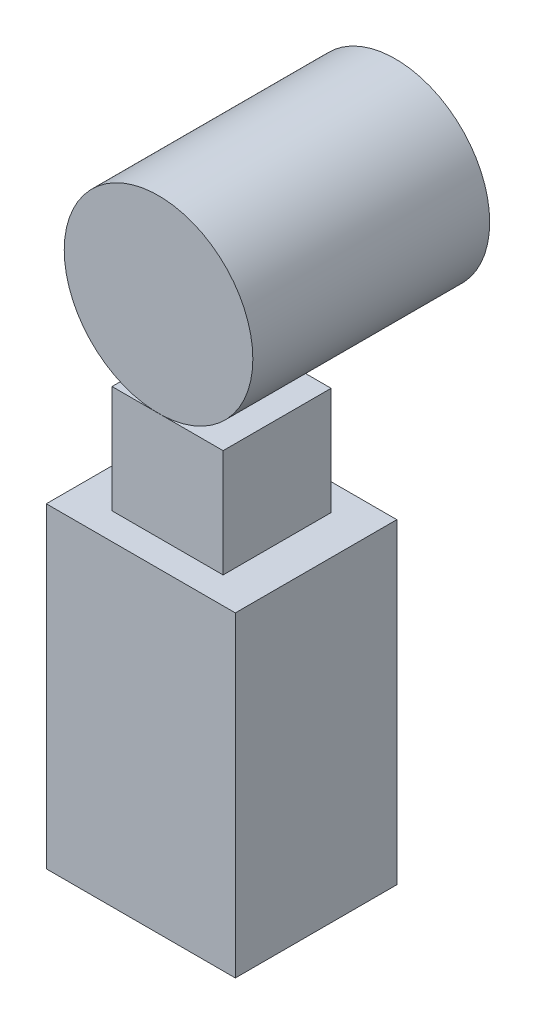
ISO-10303-21;
HEADER;
FILE_DESCRIPTION(('STEP AP214'),'2;1');
FILE_NAME('part.step','',(''),(''),'','','');
FILE_SCHEMA(('AUTOMOTIVE_DESIGN { 1 0 10303 214 1 1 1 1 }'));
ENDSEC;
DATA;
#1=APPLICATION_CONTEXT('core data for automotive mechanical design processes');
#2=APPLICATION_PROTOCOL_DEFINITION('international standard','automotive_design',2000,#1);
#3=PRODUCT_CONTEXT('',#1,'mechanical');
#4=PRODUCT('Part','Part','',(#3));
#5=PRODUCT_RELATED_PRODUCT_CATEGORY('part','',(#4));
#6=PRODUCT_DEFINITION_FORMATION('','',#4);
#7=PRODUCT_DEFINITION_CONTEXT('part definition',#1,'design');
#8=PRODUCT_DEFINITION('design','',#6,#7);
#9=PRODUCT_DEFINITION_SHAPE('','',#8);
#10=(LENGTH_UNIT() NAMED_UNIT(*) SI_UNIT(.MILLI.,.METRE.));
#11=(NAMED_UNIT(*) PLANE_ANGLE_UNIT() SI_UNIT($,.RADIAN.));
#12=(NAMED_UNIT(*) SI_UNIT($,.STERADIAN.) SOLID_ANGLE_UNIT());
#13=UNCERTAINTY_MEASURE_WITH_UNIT(LENGTH_MEASURE(1.E-05),#10,'distance_accuracy_value','');
#14=(GEOMETRIC_REPRESENTATION_CONTEXT(3) GLOBAL_UNCERTAINTY_ASSIGNED_CONTEXT((#13)) GLOBAL_UNIT_ASSIGNED_CONTEXT((#10,
#11,#12)) REPRESENTATION_CONTEXT('',''));
#15=CARTESIAN_POINT('',(0.,0.,0.));
#16=DIRECTION('',(0.,0.,1.));
#17=DIRECTION('',(1.,0.,0.));
#18=AXIS2_PLACEMENT_3D('',#15,#16,#17);
#19=CARTESIAN_POINT('',(-19.7896230919312,120.654551355997,-37.9342966570362));
#20=DIRECTION('',(0.,0.,1.));
#21=DIRECTION('',(1.,0.,0.));
#22=AXIS2_PLACEMENT_3D('',#19,#20,#21);
#23=CYLINDRICAL_SURFACE('',#22,35.0378632641428);
#24=CARTESIAN_POINT('',(-19.7896230919312,120.654551355997,-37.9342966570362));
#25=DIRECTION('',(0.,0.,1.));
#26=DIRECTION('',(1.,0.,0.));
#27=AXIS2_PLACEMENT_3D('',#24,#25,#26);
#28=CIRCLE('',#27,35.0378632641428);
#29=CARTESIAN_POINT('',(15.2482401722116,120.654551355997,-37.9342966570362));
#30=VERTEX_POINT('',#29);
#31=EDGE_CURVE('E11',#30,#30,#28,.T.);
#32=ORIENTED_EDGE('',*,*,#31,.T.);
#33=EDGE_LOOP('',(#32));
#34=FACE_BOUND('',#33,.T.);
#35=CARTESIAN_POINT('',(-19.7896230919312,120.654551355997,50.0657033429638));
#36=DIRECTION('',(0.,0.,1.));
#37=DIRECTION('',(1.,0.,0.));
#38=AXIS2_PLACEMENT_3D('',#35,#36,#37);
#39=CIRCLE('',#38,35.0378632641428);
#40=CARTESIAN_POINT('',(15.2482401722116,120.654551355997,50.0657033429638));
#41=VERTEX_POINT('',#40);
#42=EDGE_CURVE('E44',#41,#41,#39,.T.);
#43=ORIENTED_EDGE('',*,*,#42,.F.);
#44=EDGE_LOOP('',(#43));
#45=FACE_BOUND('',#44,.T.);
#46=ADVANCED_FACE('F41',(#34,#45),#23,.T.);
#47=CARTESIAN_POINT('',(-19.7896230919312,120.654551355997,-37.9342966570362));
#48=DIRECTION('',(0.,0.,1.));
#49=DIRECTION('',(1.,0.,0.));
#50=AXIS2_PLACEMENT_3D('',#47,#48,#49);
#51=PLANE('',#50);
#52=ORIENTED_EDGE('',*,*,#31,.F.);
#53=EDGE_LOOP('',(#52));
#54=FACE_BOUND('',#53,.T.);
#55=ADVANCED_FACE('F56',(#54),#51,.F.);
#56=CARTESIAN_POINT('',(-19.7896230919312,120.654551355997,50.0657033429638));
#57=DIRECTION('',(0.,0.,1.));
#58=DIRECTION('',(1.,0.,0.));
#59=AXIS2_PLACEMENT_3D('',#56,#57,#58);
#60=PLANE('',#59);
#61=ORIENTED_EDGE('',*,*,#42,.T.);
#62=EDGE_LOOP('',(#61));
#63=FACE_BOUND('',#62,.T.);
#64=ADVANCED_FACE('F53',(#63),#60,.T.);
#65=CLOSED_SHELL('',(#46,#55,#64));
#66=MANIFOLD_SOLID_BREP('B2',#65);
#67=CARTESIAN_POINT('',(-51.5518004325486,45.6166880918545,60.));
#68=DIRECTION('',(0.,-1.,0.));
#69=DIRECTION('',(0.,0.,-1.));
#70=AXIS2_PLACEMENT_3D('',#67,#68,#69);
#71=PLANE('',#70);
#72=DIRECTION('',(-1.,0.,0.));
#73=VECTOR('',#72,1.);
#74=CARTESIAN_POINT('',(-51.5518004325486,45.6166880918545,0.));
#75=LINE('',#74,#73);
#76=CARTESIAN_POINT('',(18.6789460491354,45.6166880918545,0.));
#77=VERTEX_POINT('',#76);
#78=CARTESIAN_POINT('',(-51.5518004325486,45.6166880918545,0.));
#79=VERTEX_POINT('',#78);
#80=EDGE_CURVE('E170',#77,#79,#75,.T.);
#81=ORIENTED_EDGE('',*,*,#80,.T.);
#82=DIRECTION('',(0.,0.,-1.));
#83=VECTOR('',#82,1.);
#84=CARTESIAN_POINT('',(-51.5518004325486,45.6166880918545,60.));
#85=LINE('',#84,#83);
#86=CARTESIAN_POINT('',(-51.5518004325486,45.6166880918545,60.));
#87=VERTEX_POINT('',#86);
#88=EDGE_CURVE('E90',#87,#79,#85,.T.);
#89=ORIENTED_EDGE('',*,*,#88,.F.);
#90=DIRECTION('',(-1.,0.,0.));
#91=VECTOR('',#90,1.);
#92=CARTESIAN_POINT('',(-51.5518004325486,45.6166880918545,60.));
#93=LINE('',#92,#91);
#94=CARTESIAN_POINT('',(18.6789460491354,45.6166880918545,60.));
#95=VERTEX_POINT('',#94);
#96=EDGE_CURVE('E179',#95,#87,#93,.T.);
#97=ORIENTED_EDGE('',*,*,#96,.F.);
#98=DIRECTION('',(0.,0.,-1.));
#99=VECTOR('',#98,1.);
#100=CARTESIAN_POINT('',(18.6789460491354,45.6166880918545,60.));
#101=LINE('',#100,#99);
#102=EDGE_CURVE('E39',#95,#77,#101,.T.);
#103=ORIENTED_EDGE('',*,*,#102,.T.);
#104=EDGE_LOOP('',(#81,#89,#97,#103));
#105=FACE_BOUND('',#104,.T.);
#106=DIRECTION('',(0.,0.,1.));
#107=VECTOR('',#106,1.);
#108=CARTESIAN_POINT('',(-37.072848430455,45.6166880918545,50.0657033429638));
#109=LINE('',#108,#107);
#110=CARTESIAN_POINT('',(-37.072848430455,45.6166880918545,9.93429665703616));
#111=VERTEX_POINT('',#110);
#112=CARTESIAN_POINT('',(-37.072848430455,45.6166880918545,50.0657033429638));
#113=VERTEX_POINT('',#112);
#114=EDGE_CURVE('E97',#111,#113,#109,.T.);
#115=ORIENTED_EDGE('',*,*,#114,.F.);
#116=DIRECTION('',(-1.,0.,0.));
#117=VECTOR('',#116,1.);
#118=CARTESIAN_POINT('',(4.19999404704186,45.6166880918545,9.93429665703616));
#119=LINE('',#118,#117);
#120=CARTESIAN_POINT('',(4.19999404704186,45.6166880918545,9.93429665703616));
#121=VERTEX_POINT('',#120);
#122=EDGE_CURVE('E101',#121,#111,#119,.T.);
#123=ORIENTED_EDGE('',*,*,#122,.F.);
#124=DIRECTION('',(0.,0.,-1.));
#125=VECTOR('',#124,1.);
#126=CARTESIAN_POINT('',(4.19999404704186,45.6166880918545,50.0657033429638));
#127=LINE('',#126,#125);
#128=CARTESIAN_POINT('',(4.19999404704186,45.6166880918545,50.0657033429638));
#129=VERTEX_POINT('',#128);
#130=EDGE_CURVE('E303',#129,#121,#127,.T.);
#131=ORIENTED_EDGE('',*,*,#130,.F.);
#132=DIRECTION('',(1.,0.,0.));
#133=VECTOR('',#132,1.);
#134=CARTESIAN_POINT('',(4.19999404704186,45.6166880918545,50.0657033429638));
#135=LINE('',#134,#133);
#136=EDGE_CURVE('E309',#113,#129,#135,.T.);
#137=ORIENTED_EDGE('',*,*,#136,.F.);
#138=EDGE_LOOP('',(#115,#123,#131,#137));
#139=FACE_BOUND('',#138,.T.);
#140=ADVANCED_FACE('F82',(#105,#139),#71,.F.);
#141=CARTESIAN_POINT('',(18.6789460491354,-71.8594149399223,60.));
#142=DIRECTION('',(-1.,0.,0.));
#143=DIRECTION('',(0.,0.,1.));
#144=AXIS2_PLACEMENT_3D('',#141,#142,#143);
#145=PLANE('',#144);
#146=DIRECTION('',(0.,1.,0.));
#147=VECTOR('',#146,1.);
#148=CARTESIAN_POINT('',(18.6789460491354,-71.8594149399223,0.));
#149=LINE('',#148,#147);
#150=CARTESIAN_POINT('',(18.6789460491354,-71.8594149399223,0.));
#151=VERTEX_POINT('',#150);
#152=EDGE_CURVE('E167',#151,#77,#149,.T.);
#153=ORIENTED_EDGE('',*,*,#152,.T.);
#154=ORIENTED_EDGE('',*,*,#102,.F.);
#155=DIRECTION('',(0.,1.,0.));
#156=VECTOR('',#155,1.);
#157=CARTESIAN_POINT('',(18.6789460491354,-71.8594149399223,60.));
#158=LINE('',#157,#156);
#159=CARTESIAN_POINT('',(18.6789460491354,-71.8594149399223,60.));
#160=VERTEX_POINT('',#159);
#161=EDGE_CURVE('E176',#160,#95,#158,.T.);
#162=ORIENTED_EDGE('',*,*,#161,.F.);
#163=DIRECTION('',(0.,0.,-1.));
#164=VECTOR('',#163,1.);
#165=CARTESIAN_POINT('',(18.6789460491354,-71.8594149399223,60.));
#166=LINE('',#165,#164);
#167=EDGE_CURVE('E185',#160,#151,#166,.T.);
#168=ORIENTED_EDGE('',*,*,#167,.T.);
#169=EDGE_LOOP('',(#153,#154,#162,#168));
#170=FACE_BOUND('',#169,.T.);
#171=ADVANCED_FACE('F84',(#170),#145,.F.);
#172=CARTESIAN_POINT('',(-51.5518004325486,-71.8594149399223,60.));
#173=DIRECTION('',(1.,0.,0.));
#174=DIRECTION('',(0.,0.,-1.));
#175=AXIS2_PLACEMENT_3D('',#172,#173,#174);
#176=PLANE('',#175);
#177=DIRECTION('',(0.,-1.,0.));
#178=VECTOR('',#177,1.);
#179=CARTESIAN_POINT('',(-51.5518004325486,-71.8594149399223,0.));
#180=LINE('',#179,#178);
#181=CARTESIAN_POINT('',(-51.5518004325486,-71.8594149399223,0.));
#182=VERTEX_POINT('',#181);
#183=EDGE_CURVE('E188',#79,#182,#180,.T.);
#184=ORIENTED_EDGE('',*,*,#183,.T.);
#185=DIRECTION('',(0.,0.,-1.));
#186=VECTOR('',#185,1.);
#187=CARTESIAN_POINT('',(-51.5518004325486,-71.8594149399223,60.));
#188=LINE('',#187,#186);
#189=CARTESIAN_POINT('',(-51.5518004325486,-71.8594149399223,60.));
#190=VERTEX_POINT('',#189);
#191=EDGE_CURVE('E193',#190,#182,#188,.T.);
#192=ORIENTED_EDGE('',*,*,#191,.F.);
#193=DIRECTION('',(0.,-1.,0.));
#194=VECTOR('',#193,1.);
#195=CARTESIAN_POINT('',(-51.5518004325486,-71.8594149399223,60.));
#196=LINE('',#195,#194);
#197=EDGE_CURVE('E182',#87,#190,#196,.T.);
#198=ORIENTED_EDGE('',*,*,#197,.F.);
#199=ORIENTED_EDGE('',*,*,#88,.T.);
#200=EDGE_LOOP('',(#184,#192,#198,#199));
#201=FACE_BOUND('',#200,.T.);
#202=ADVANCED_FACE('F200',(#201),#176,.F.);
#203=CARTESIAN_POINT('',(-51.5518004325486,-71.8594149399223,60.));
#204=DIRECTION('',(0.,1.,0.));
#205=DIRECTION('',(0.,0.,1.));
#206=AXIS2_PLACEMENT_3D('',#203,#204,#205);
#207=PLANE('',#206);
#208=DIRECTION('',(1.,0.,0.));
#209=VECTOR('',#208,1.);
#210=CARTESIAN_POINT('',(-51.5518004325486,-71.8594149399223,0.));
#211=LINE('',#210,#209);
#212=EDGE_CURVE('E180',#182,#151,#211,.T.);
#213=ORIENTED_EDGE('',*,*,#212,.T.);
#214=ORIENTED_EDGE('',*,*,#167,.F.);
#215=DIRECTION('',(1.,0.,0.));
#216=VECTOR('',#215,1.);
#217=CARTESIAN_POINT('',(-51.5518004325486,-71.8594149399223,60.));
#218=LINE('',#217,#216);
#219=EDGE_CURVE('E184',#190,#160,#218,.T.);
#220=ORIENTED_EDGE('',*,*,#219,.F.);
#221=ORIENTED_EDGE('',*,*,#191,.T.);
#222=EDGE_LOOP('',(#213,#214,#220,#221));
#223=FACE_BOUND('',#222,.T.);
#224=ADVANCED_FACE('F209',(#223),#207,.F.);
#225=CARTESIAN_POINT('',(0.,0.,60.));
#226=DIRECTION('',(0.,0.,-1.));
#227=DIRECTION('',(-1.,0.,0.));
#228=AXIS2_PLACEMENT_3D('',#225,#226,#227);
#229=PLANE('',#228);
#230=ORIENTED_EDGE('',*,*,#161,.T.);
#231=ORIENTED_EDGE('',*,*,#96,.T.);
#232=ORIENTED_EDGE('',*,*,#197,.T.);
#233=ORIENTED_EDGE('',*,*,#219,.T.);
#234=EDGE_LOOP('',(#230,#231,#232,#233));
#235=FACE_BOUND('',#234,.T.);
#236=ADVANCED_FACE('F215',(#235),#229,.F.);
#237=CARTESIAN_POINT('',(0.,0.,0.));
#238=DIRECTION('',(0.,0.,-1.));
#239=DIRECTION('',(-1.,0.,0.));
#240=AXIS2_PLACEMENT_3D('',#237,#238,#239);
#241=PLANE('',#240);
#242=ORIENTED_EDGE('',*,*,#152,.F.);
#243=ORIENTED_EDGE('',*,*,#212,.F.);
#244=ORIENTED_EDGE('',*,*,#183,.F.);
#245=ORIENTED_EDGE('',*,*,#80,.F.);
#246=EDGE_LOOP('',(#242,#243,#244,#245));
#247=FACE_BOUND('',#246,.T.);
#248=ADVANCED_FACE('F206',(#247),#241,.T.);
#249=CARTESIAN_POINT('',(-37.072848430455,85.6166880918545,50.0657033429638));
#250=DIRECTION('',(1.,0.,0.));
#251=DIRECTION('',(0.,0.,-1.));
#252=AXIS2_PLACEMENT_3D('',#249,#250,#251);
#253=PLANE('',#252);
#254=ORIENTED_EDGE('',*,*,#114,.T.);
#255=DIRECTION('',(0.,-1.,0.));
#256=VECTOR('',#255,1.);
#257=CARTESIAN_POINT('',(-37.072848430455,85.6166880918545,50.0657033429638));
#258=LINE('',#257,#256);
#259=CARTESIAN_POINT('',(-37.072848430455,85.6166880918545,50.0657033429638));
#260=VERTEX_POINT('',#259);
#261=EDGE_CURVE('E150',#260,#113,#258,.T.);
#262=ORIENTED_EDGE('',*,*,#261,.F.);
#263=DIRECTION('',(0.,0.,1.));
#264=VECTOR('',#263,1.);
#265=CARTESIAN_POINT('',(-37.072848430455,85.6166880918545,50.0657033429638));
#266=LINE('',#265,#264);
#267=CARTESIAN_POINT('',(-37.072848430455,85.6166880918545,9.93429665703616));
#268=VERTEX_POINT('',#267);
#269=EDGE_CURVE('E156',#268,#260,#266,.T.);
#270=ORIENTED_EDGE('',*,*,#269,.F.);
#271=DIRECTION('',(0.,-1.,0.));
#272=VECTOR('',#271,1.);
#273=CARTESIAN_POINT('',(-37.072848430455,85.6166880918545,9.93429665703616));
#274=LINE('',#273,#272);
#275=EDGE_CURVE('E301',#268,#111,#274,.T.);
#276=ORIENTED_EDGE('',*,*,#275,.T.);
#277=EDGE_LOOP('',(#254,#262,#270,#276));
#278=FACE_BOUND('',#277,.T.);
#279=ADVANCED_FACE('F166',(#278),#253,.F.);
#280=CARTESIAN_POINT('',(4.19999404704186,85.6166880918545,50.0657033429638));
#281=DIRECTION('',(0.,0.,-1.));
#282=DIRECTION('',(-1.,0.,0.));
#283=AXIS2_PLACEMENT_3D('',#280,#281,#282);
#284=PLANE('',#283);
#285=ORIENTED_EDGE('',*,*,#136,.T.);
#286=DIRECTION('',(0.,-1.,0.));
#287=VECTOR('',#286,1.);
#288=CARTESIAN_POINT('',(4.19999404704186,85.6166880918545,50.0657033429638));
#289=LINE('',#288,#287);
#290=CARTESIAN_POINT('',(4.19999404704186,85.6166880918545,50.0657033429638));
#291=VERTEX_POINT('',#290);
#292=EDGE_CURVE('E152',#291,#129,#289,.T.);
#293=ORIENTED_EDGE('',*,*,#292,.F.);
#294=DIRECTION('',(1.,0.,0.));
#295=VECTOR('',#294,1.);
#296=CARTESIAN_POINT('',(4.19999404704186,85.6166880918545,50.0657033429638));
#297=LINE('',#296,#295);
#298=EDGE_CURVE('E145',#260,#291,#297,.T.);
#299=ORIENTED_EDGE('',*,*,#298,.F.);
#300=ORIENTED_EDGE('',*,*,#261,.T.);
#301=EDGE_LOOP('',(#285,#293,#299,#300));
#302=FACE_BOUND('',#301,.T.);
#303=ADVANCED_FACE('F148',(#302),#284,.F.);
#304=CARTESIAN_POINT('',(4.19999404704186,85.6166880918545,50.0657033429638));
#305=DIRECTION('',(-1.,0.,0.));
#306=DIRECTION('',(0.,0.,1.));
#307=AXIS2_PLACEMENT_3D('',#304,#305,#306);
#308=PLANE('',#307);
#309=ORIENTED_EDGE('',*,*,#130,.T.);
#310=DIRECTION('',(0.,-1.,0.));
#311=VECTOR('',#310,1.);
#312=CARTESIAN_POINT('',(4.19999404704186,85.6166880918545,9.93429665703616));
#313=LINE('',#312,#311);
#314=CARTESIAN_POINT('',(4.19999404704186,85.6166880918545,9.93429665703616));
#315=VERTEX_POINT('',#314);
#316=EDGE_CURVE('E172',#315,#121,#313,.T.);
#317=ORIENTED_EDGE('',*,*,#316,.F.);
#318=DIRECTION('',(0.,0.,-1.));
#319=VECTOR('',#318,1.);
#320=CARTESIAN_POINT('',(4.19999404704186,85.6166880918545,50.0657033429638));
#321=LINE('',#320,#319);
#322=EDGE_CURVE('E155',#291,#315,#321,.T.);
#323=ORIENTED_EDGE('',*,*,#322,.F.);
#324=ORIENTED_EDGE('',*,*,#292,.T.);
#325=EDGE_LOOP('',(#309,#317,#323,#324));
#326=FACE_BOUND('',#325,.T.);
#327=ADVANCED_FACE('F233',(#326),#308,.F.);
#328=CARTESIAN_POINT('',(4.19999404704186,85.6166880918545,9.93429665703616));
#329=DIRECTION('',(0.,0.,1.));
#330=DIRECTION('',(1.,0.,0.));
#331=AXIS2_PLACEMENT_3D('',#328,#329,#330);
#332=PLANE('',#331);
#333=ORIENTED_EDGE('',*,*,#122,.T.);
#334=ORIENTED_EDGE('',*,*,#275,.F.);
#335=DIRECTION('',(-1.,0.,0.));
#336=VECTOR('',#335,1.);
#337=CARTESIAN_POINT('',(4.19999404704186,85.6166880918545,9.93429665703616));
#338=LINE('',#337,#336);
#339=EDGE_CURVE('E161',#315,#268,#338,.T.);
#340=ORIENTED_EDGE('',*,*,#339,.F.);
#341=ORIENTED_EDGE('',*,*,#316,.T.);
#342=EDGE_LOOP('',(#333,#334,#340,#341));
#343=FACE_BOUND('',#342,.T.);
#344=ADVANCED_FACE('F236',(#343),#332,.F.);
#345=CARTESIAN_POINT('',(0.,85.6166880918545,0.));
#346=DIRECTION('',(0.,1.,0.));
#347=DIRECTION('',(0.,0.,1.));
#348=AXIS2_PLACEMENT_3D('',#345,#346,#347);
#349=PLANE('',#348);
#350=ORIENTED_EDGE('',*,*,#298,.T.);
#351=ORIENTED_EDGE('',*,*,#322,.T.);
#352=ORIENTED_EDGE('',*,*,#339,.T.);
#353=ORIENTED_EDGE('',*,*,#269,.T.);
#354=EDGE_LOOP('',(#350,#351,#352,#353));
#355=FACE_BOUND('',#354,.T.);
#356=ADVANCED_FACE('F159',(#355),#349,.T.);
#357=CLOSED_SHELL('',(#140,#171,#202,#224,#236,#248,#279,#303,#327,#344,#356));
#358=MANIFOLD_SOLID_BREP('B6',#357);
#359=ADVANCED_BREP_SHAPE_REPRESENTATION('',(#18,#66,#358),#14);
#360=SHAPE_DEFINITION_REPRESENTATION(#9,#359);
ENDSEC;
END-ISO-10303-21;
